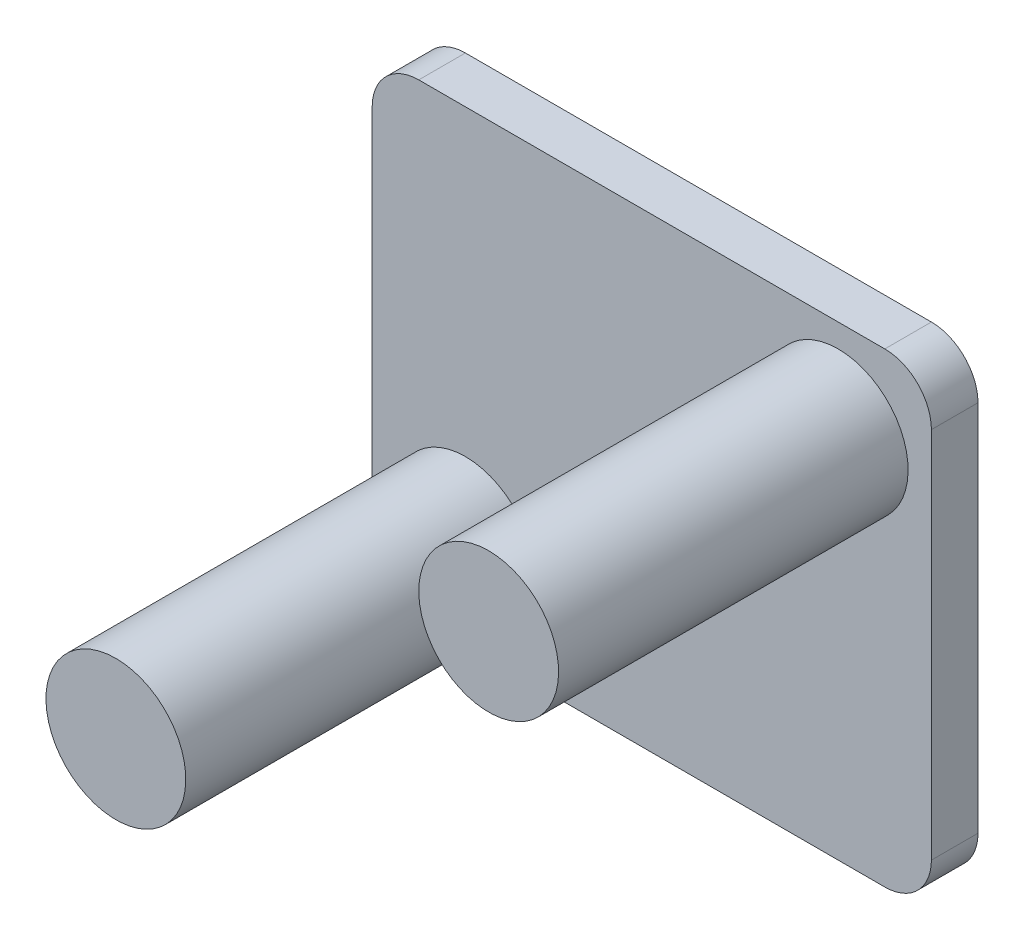
ISO-10303-21;
HEADER;
FILE_DESCRIPTION(('STEP AP214'),'2;1');
FILE_NAME('part.step','',(''),(''),'','','');
FILE_SCHEMA(('AUTOMOTIVE_DESIGN { 1 0 10303 214 1 1 1 1 }'));
ENDSEC;
DATA;
#1=APPLICATION_CONTEXT('core data for automotive mechanical design processes');
#2=APPLICATION_PROTOCOL_DEFINITION('international standard','automotive_design',2000,#1);
#3=PRODUCT_CONTEXT('',#1,'mechanical');
#4=PRODUCT('Part','Part','',(#3));
#5=PRODUCT_RELATED_PRODUCT_CATEGORY('part','',(#4));
#6=PRODUCT_DEFINITION_FORMATION('','',#4);
#7=PRODUCT_DEFINITION_CONTEXT('part definition',#1,'design');
#8=PRODUCT_DEFINITION('design','',#6,#7);
#9=PRODUCT_DEFINITION_SHAPE('','',#8);
#10=(LENGTH_UNIT() NAMED_UNIT(*) SI_UNIT(.MILLI.,.METRE.));
#11=(NAMED_UNIT(*) PLANE_ANGLE_UNIT() SI_UNIT($,.RADIAN.));
#12=(NAMED_UNIT(*) SI_UNIT($,.STERADIAN.) SOLID_ANGLE_UNIT());
#13=UNCERTAINTY_MEASURE_WITH_UNIT(LENGTH_MEASURE(1.E-05),#10,'distance_accuracy_value','');
#14=(GEOMETRIC_REPRESENTATION_CONTEXT(3) GLOBAL_UNCERTAINTY_ASSIGNED_CONTEXT((#13)) GLOBAL_UNIT_ASSIGNED_CONTEXT((#10,
#11,#12)) REPRESENTATION_CONTEXT('',''));
#15=CARTESIAN_POINT('',(0.,0.,0.));
#16=DIRECTION('',(0.,0.,1.));
#17=DIRECTION('',(1.,0.,0.));
#18=AXIS2_PLACEMENT_3D('',#15,#16,#17);
#19=CARTESIAN_POINT('',(5.5,3.,8.5));
#20=DIRECTION('',(0.,0.,-1.));
#21=DIRECTION('',(0.,1.,0.));
#22=AXIS2_PLACEMENT_3D('',#19,#20,#21);
#23=PLANE('',#22);
#24=CARTESIAN_POINT('',(4.,3.,8.5));
#25=DIRECTION('',(0.,0.,-1.));
#26=DIRECTION('',(0.,1.,0.));
#27=AXIS2_PLACEMENT_3D('',#24,#25,#26);
#28=CIRCLE('',#27,1.5);
#29=CARTESIAN_POINT('',(4.,4.5,8.5));
#30=VERTEX_POINT('',#29);
#31=EDGE_CURVE('E20',#30,#30,#28,.T.);
#32=ORIENTED_EDGE('',*,*,#31,.F.);
#33=EDGE_LOOP('',(#32));
#34=FACE_BOUND('',#33,.T.);
#35=ADVANCED_FACE('F17',(#34),#23,.F.);
#36=CARTESIAN_POINT('',(-2.5,-3.,8.5));
#37=DIRECTION('',(0.,0.,-1.));
#38=DIRECTION('',(0.,1.,0.));
#39=AXIS2_PLACEMENT_3D('',#36,#37,#38);
#40=PLANE('',#39);
#41=CARTESIAN_POINT('',(-4.,-3.,8.5));
#42=DIRECTION('',(0.,0.,-1.));
#43=DIRECTION('',(0.,1.,0.));
#44=AXIS2_PLACEMENT_3D('',#41,#42,#43);
#45=CIRCLE('',#44,1.5);
#46=CARTESIAN_POINT('',(-4.,-1.5,8.5));
#47=VERTEX_POINT('',#46);
#48=EDGE_CURVE('E140',#47,#47,#45,.T.);
#49=ORIENTED_EDGE('',*,*,#48,.F.);
#50=EDGE_LOOP('',(#49));
#51=FACE_BOUND('',#50,.T.);
#52=ADVANCED_FACE('F151',(#51),#40,.F.);
#53=CARTESIAN_POINT('',(4.,3.,1.));
#54=DIRECTION('',(0.,0.,-1.));
#55=DIRECTION('',(0.,1.,0.));
#56=AXIS2_PLACEMENT_3D('',#53,#54,#55);
#57=CYLINDRICAL_SURFACE('',#56,1.5);
#58=ORIENTED_EDGE('',*,*,#31,.T.);
#59=EDGE_LOOP('',(#58));
#60=FACE_BOUND('',#59,.T.);
#61=CARTESIAN_POINT('',(4.,3.,1.));
#62=DIRECTION('',(0.,0.,-1.));
#63=DIRECTION('',(0.,1.,0.));
#64=AXIS2_PLACEMENT_3D('',#61,#62,#63);
#65=CIRCLE('',#64,1.5);
#66=CARTESIAN_POINT('',(4.,4.5,0.999999999999999));
#67=VERTEX_POINT('',#66);
#68=EDGE_CURVE('E138',#67,#67,#65,.F.);
#69=ORIENTED_EDGE('',*,*,#68,.T.);
#70=EDGE_LOOP('',(#69));
#71=FACE_BOUND('',#70,.T.);
#72=ADVANCED_FACE('F147',(#60,#71),#57,.T.);
#73=CARTESIAN_POINT('',(-4.,-3.,1.));
#74=DIRECTION('',(0.,0.,-1.));
#75=DIRECTION('',(0.,1.,0.));
#76=AXIS2_PLACEMENT_3D('',#73,#74,#75);
#77=CYLINDRICAL_SURFACE('',#76,1.5);
#78=ORIENTED_EDGE('',*,*,#48,.T.);
#79=EDGE_LOOP('',(#78));
#80=FACE_BOUND('',#79,.T.);
#81=CARTESIAN_POINT('',(-4.,-3.,1.));
#82=DIRECTION('',(0.,0.,-1.));
#83=DIRECTION('',(0.,1.,0.));
#84=AXIS2_PLACEMENT_3D('',#81,#82,#83);
#85=CIRCLE('',#84,1.5);
#86=CARTESIAN_POINT('',(-4.,-1.5,0.999999999999999));
#87=VERTEX_POINT('',#86);
#88=EDGE_CURVE('E90',#87,#87,#85,.F.);
#89=ORIENTED_EDGE('',*,*,#88,.T.);
#90=EDGE_LOOP('',(#89));
#91=FACE_BOUND('',#90,.T.);
#92=ADVANCED_FACE('F193',(#80,#91),#77,.T.);
#93=CARTESIAN_POINT('',(-4.99999999994,-4.999999999969,1.));
#94=DIRECTION('',(0.,0.,-1.));
#95=DIRECTION('',(0.,1.,0.));
#96=AXIS2_PLACEMENT_3D('',#93,#94,#95);
#97=PLANE('',#96);
#98=ORIENTED_EDGE('',*,*,#88,.F.);
#99=EDGE_LOOP('',(#98));
#100=FACE_BOUND('',#99,.T.);
#101=ORIENTED_EDGE('',*,*,#68,.F.);
#102=EDGE_LOOP('',(#101));
#103=FACE_BOUND('',#102,.T.);
#104=DIRECTION('',(0.,1.,0.));
#105=VECTOR('',#104,1.);
#106=CARTESIAN_POINT('',(6.,-4.000000000026,1.));
#107=LINE('',#106,#105);
#108=CARTESIAN_POINT('',(6.,-4.000000000026,1.));
#109=VERTEX_POINT('',#108);
#110=CARTESIAN_POINT('',(6.,4.000000000018,1.));
#111=VERTEX_POINT('',#110);
#112=EDGE_CURVE('E107',#109,#111,#107,.T.);
#113=ORIENTED_EDGE('',*,*,#112,.T.);
#114=CARTESIAN_POINT('',(5.000000000026,4.000000000018,1.));
#115=DIRECTION('',(0.,0.,-1.));
#116=DIRECTION('',(-1.,0.,0.));
#117=AXIS2_PLACEMENT_3D('',#114,#115,#116);
#118=CIRCLE('',#117,0.999999999974);
#119=CARTESIAN_POINT('',(5.000000000026,4.999999999992,1.));
#120=VERTEX_POINT('',#119);
#121=EDGE_CURVE('E110',#120,#111,#118,.T.);
#122=ORIENTED_EDGE('',*,*,#121,.F.);
#123=DIRECTION('',(1.,0.,0.));
#124=VECTOR('',#123,1.);
#125=CARTESIAN_POINT('',(5.000000000026,4.999999999992,1.));
#126=LINE('',#125,#124);
#127=CARTESIAN_POINT('',(-4.999999999989,4.999999999992,1.));
#128=VERTEX_POINT('',#127);
#129=EDGE_CURVE('E111',#120,#128,#126,.F.);
#130=ORIENTED_EDGE('',*,*,#129,.T.);
#131=CARTESIAN_POINT('',(-4.999999999989,4.000000000018,1.));
#132=DIRECTION('',(0.,0.,-1.));
#133=DIRECTION('',(-1.,0.,0.));
#134=AXIS2_PLACEMENT_3D('',#131,#132,#133);
#135=CIRCLE('',#134,0.999999999974);
#136=CARTESIAN_POINT('',(-5.9999999999815,4.000000000018,1.));
#137=VERTEX_POINT('',#136);
#138=EDGE_CURVE('E114',#137,#128,#135,.T.);
#139=ORIENTED_EDGE('',*,*,#138,.F.);
#140=DIRECTION('',(0.,1.,0.));
#141=VECTOR('',#140,1.);
#142=CARTESIAN_POINT('',(-6.,4.00000000005,1.));
#143=LINE('',#142,#141);
#144=CARTESIAN_POINT('',(-6.,-3.999999999995,1.));
#145=VERTEX_POINT('',#144);
#146=EDGE_CURVE('E87',#137,#145,#143,.F.);
#147=ORIENTED_EDGE('',*,*,#146,.T.);
#148=CARTESIAN_POINT('',(-5.000000000026,-3.999999999995,1.));
#149=DIRECTION('',(0.,0.,-1.));
#150=DIRECTION('',(-1.,0.,0.));
#151=AXIS2_PLACEMENT_3D('',#148,#149,#150);
#152=CIRCLE('',#151,0.999999999974);
#153=CARTESIAN_POINT('',(-4.999999999983,-4.999999999969,1.));
#154=VERTEX_POINT('',#153);
#155=EDGE_CURVE('E80',#154,#145,#152,.T.);
#156=ORIENTED_EDGE('',*,*,#155,.F.);
#157=DIRECTION('',(1.,0.,0.));
#158=VECTOR('',#157,1.);
#159=CARTESIAN_POINT('',(-4.99999999994,-4.999999999969,1.));
#160=LINE('',#159,#158);
#161=CARTESIAN_POINT('',(5.000000000026,-4.999999999969,1.));
#162=VERTEX_POINT('',#161);
#163=EDGE_CURVE('E85',#154,#162,#160,.T.);
#164=ORIENTED_EDGE('',*,*,#163,.T.);
#165=CARTESIAN_POINT('',(5.000000000026,-4.000000000026,1.));
#166=DIRECTION('',(0.,0.,-1.));
#167=DIRECTION('',(-1.,0.,0.));
#168=AXIS2_PLACEMENT_3D('',#165,#166,#167);
#169=CIRCLE('',#168,0.999999999974);
#170=EDGE_CURVE('E98',#109,#162,#169,.T.);
#171=ORIENTED_EDGE('',*,*,#170,.F.);
#172=EDGE_LOOP('',(#113,#122,#130,#139,#147,#156,#164,#171));
#173=FACE_BOUND('',#172,.T.);
#174=ADVANCED_FACE('F82',(#100,#103,#173),#97,.F.);
#175=CARTESIAN_POINT('',(-5.000000000026,-3.999999999995,0.));
#176=DIRECTION('',(0.,0.,-1.));
#177=DIRECTION('',(-1.,0.,0.));
#178=AXIS2_PLACEMENT_3D('',#175,#176,#177);
#179=CYLINDRICAL_SURFACE('',#178,0.999999999974);
#180=ORIENTED_EDGE('',*,*,#155,.T.);
#181=DIRECTION('',(0.,0.,-1.));
#182=VECTOR('',#181,1.);
#183=CARTESIAN_POINT('',(-6.,-3.999999999995,0.));
#184=LINE('',#183,#182);
#185=CARTESIAN_POINT('',(-6.,-3.999999999995,0.));
#186=VERTEX_POINT('',#185);
#187=EDGE_CURVE('E105',#145,#186,#184,.T.);
#188=ORIENTED_EDGE('',*,*,#187,.T.);
#189=CARTESIAN_POINT('',(-5.000000000026,-3.999999999995,0.));
#190=DIRECTION('',(0.,0.,-1.));
#191=DIRECTION('',(-1.,0.,0.));
#192=AXIS2_PLACEMENT_3D('',#189,#190,#191);
#193=CIRCLE('',#192,0.999999999974);
#194=CARTESIAN_POINT('',(-4.999999999983,-4.9999999999765,0.));
#195=VERTEX_POINT('',#194);
#196=EDGE_CURVE('E96',#195,#186,#193,.T.);
#197=ORIENTED_EDGE('',*,*,#196,.F.);
#198=DIRECTION('',(0.,0.,1.));
#199=VECTOR('',#198,1.);
#200=CARTESIAN_POINT('',(-4.99999999994,-4.999999999969,0.));
#201=LINE('',#200,#199);
#202=EDGE_CURVE('E93',#195,#154,#201,.T.);
#203=ORIENTED_EDGE('',*,*,#202,.T.);
#204=EDGE_LOOP('',(#180,#188,#197,#203));
#205=FACE_BOUND('',#204,.T.);
#206=ADVANCED_FACE('F94',(#205),#179,.T.);
#207=CARTESIAN_POINT('',(-6.,4.00000000005,0.));
#208=DIRECTION('',(1.,0.,0.));
#209=DIRECTION('',(0.,0.,-1.));
#210=AXIS2_PLACEMENT_3D('',#207,#208,#209);
#211=PLANE('',#210);
#212=ORIENTED_EDGE('',*,*,#187,.F.);
#213=ORIENTED_EDGE('',*,*,#146,.F.);
#214=DIRECTION('',(0.,0.,-1.));
#215=VECTOR('',#214,1.);
#216=CARTESIAN_POINT('',(-5.999999999963,4.000000000018,0.));
#217=LINE('',#216,#215);
#218=CARTESIAN_POINT('',(-5.9999999999815,4.000000000018,0.));
#219=VERTEX_POINT('',#218);
#220=EDGE_CURVE('E134',#219,#137,#217,.F.);
#221=ORIENTED_EDGE('',*,*,#220,.F.);
#222=DIRECTION('',(0.,1.,0.));
#223=VECTOR('',#222,1.);
#224=CARTESIAN_POINT('',(-6.,-4.999999999969,0.));
#225=LINE('',#224,#223);
#226=EDGE_CURVE('E126',#186,#219,#225,.T.);
#227=ORIENTED_EDGE('',*,*,#226,.F.);
#228=EDGE_LOOP('',(#212,#213,#221,#227));
#229=FACE_BOUND('',#228,.T.);
#230=ADVANCED_FACE('F184',(#229),#211,.F.);
#231=CARTESIAN_POINT('',(-4.999999999989,4.000000000018,0.));
#232=DIRECTION('',(0.,0.,-1.));
#233=DIRECTION('',(-1.,0.,0.));
#234=AXIS2_PLACEMENT_3D('',#231,#232,#233);
#235=CYLINDRICAL_SURFACE('',#234,0.999999999974);
#236=ORIENTED_EDGE('',*,*,#138,.T.);
#237=DIRECTION('',(0.,0.,-1.));
#238=VECTOR('',#237,1.);
#239=CARTESIAN_POINT('',(-4.999999999989,4.999999999992,0.));
#240=LINE('',#239,#238);
#241=CARTESIAN_POINT('',(-4.999999999989,4.999999999992,0.));
#242=VERTEX_POINT('',#241);
#243=EDGE_CURVE('E113',#128,#242,#240,.T.);
#244=ORIENTED_EDGE('',*,*,#243,.T.);
#245=CARTESIAN_POINT('',(-4.999999999989,4.000000000018,0.));
#246=DIRECTION('',(0.,0.,-1.));
#247=DIRECTION('',(-1.,0.,0.));
#248=AXIS2_PLACEMENT_3D('',#245,#246,#247);
#249=CIRCLE('',#248,0.999999999974);
#250=EDGE_CURVE('E123',#219,#242,#249,.T.);
#251=ORIENTED_EDGE('',*,*,#250,.F.);
#252=ORIENTED_EDGE('',*,*,#220,.T.);
#253=EDGE_LOOP('',(#236,#244,#251,#252));
#254=FACE_BOUND('',#253,.T.);
#255=ADVANCED_FACE('F180',(#254),#235,.T.);
#256=CARTESIAN_POINT('',(5.000000000026,4.999999999992,0.));
#257=DIRECTION('',(0.,-1.,0.));
#258=DIRECTION('',(0.,0.,-1.));
#259=AXIS2_PLACEMENT_3D('',#256,#257,#258);
#260=PLANE('',#259);
#261=ORIENTED_EDGE('',*,*,#243,.F.);
#262=ORIENTED_EDGE('',*,*,#129,.F.);
#263=DIRECTION('',(0.,0.,-1.));
#264=VECTOR('',#263,1.);
#265=CARTESIAN_POINT('',(5.000000000026,4.999999999992,0.));
#266=LINE('',#265,#264);
#267=CARTESIAN_POINT('',(5.000000000026,4.999999999992,0.));
#268=VERTEX_POINT('',#267);
#269=EDGE_CURVE('E132',#268,#120,#266,.F.);
#270=ORIENTED_EDGE('',*,*,#269,.F.);
#271=DIRECTION('',(1.,0.,0.));
#272=VECTOR('',#271,1.);
#273=CARTESIAN_POINT('',(-4.99999999994,4.999999999992,0.));
#274=LINE('',#273,#272);
#275=EDGE_CURVE('E122',#242,#268,#274,.T.);
#276=ORIENTED_EDGE('',*,*,#275,.F.);
#277=EDGE_LOOP('',(#261,#262,#270,#276));
#278=FACE_BOUND('',#277,.T.);
#279=ADVANCED_FACE('F176',(#278),#260,.F.);
#280=CARTESIAN_POINT('',(5.000000000026,4.000000000018,0.));
#281=DIRECTION('',(0.,0.,-1.));
#282=DIRECTION('',(-1.,0.,0.));
#283=AXIS2_PLACEMENT_3D('',#280,#281,#282);
#284=CYLINDRICAL_SURFACE('',#283,0.999999999974);
#285=ORIENTED_EDGE('',*,*,#121,.T.);
#286=DIRECTION('',(0.,0.,1.));
#287=VECTOR('',#286,1.);
#288=CARTESIAN_POINT('',(6.,4.000000000018,0.));
#289=LINE('',#288,#287);
#290=CARTESIAN_POINT('',(6.,4.000000000018,0.));
#291=VERTEX_POINT('',#290);
#292=EDGE_CURVE('E109',#111,#291,#289,.F.);
#293=ORIENTED_EDGE('',*,*,#292,.T.);
#294=CARTESIAN_POINT('',(5.000000000026,4.000000000018,0.));
#295=DIRECTION('',(0.,0.,-1.));
#296=DIRECTION('',(-1.,0.,0.));
#297=AXIS2_PLACEMENT_3D('',#294,#295,#296);
#298=CIRCLE('',#297,0.999999999974);
#299=EDGE_CURVE('E119',#268,#291,#298,.T.);
#300=ORIENTED_EDGE('',*,*,#299,.F.);
#301=ORIENTED_EDGE('',*,*,#269,.T.);
#302=EDGE_LOOP('',(#285,#293,#300,#301));
#303=FACE_BOUND('',#302,.T.);
#304=ADVANCED_FACE('F172',(#303),#284,.T.);
#305=CARTESIAN_POINT('',(6.,-4.000000000026,0.));
#306=DIRECTION('',(-1.,0.,0.));
#307=DIRECTION('',(0.,0.,1.));
#308=AXIS2_PLACEMENT_3D('',#305,#306,#307);
#309=PLANE('',#308);
#310=ORIENTED_EDGE('',*,*,#292,.F.);
#311=ORIENTED_EDGE('',*,*,#112,.F.);
#312=DIRECTION('',(0.,0.,-1.));
#313=VECTOR('',#312,1.);
#314=CARTESIAN_POINT('',(6.,-4.000000000026,0.));
#315=LINE('',#314,#313);
#316=CARTESIAN_POINT('',(6.,-4.000000000026,0.));
#317=VERTEX_POINT('',#316);
#318=EDGE_CURVE('E129',#317,#109,#315,.F.);
#319=ORIENTED_EDGE('',*,*,#318,.F.);
#320=DIRECTION('',(0.,1.,0.));
#321=VECTOR('',#320,1.);
#322=CARTESIAN_POINT('',(6.,-4.999999999969,0.));
#323=LINE('',#322,#321);
#324=EDGE_CURVE('E118',#291,#317,#323,.F.);
#325=ORIENTED_EDGE('',*,*,#324,.F.);
#326=EDGE_LOOP('',(#310,#311,#319,#325));
#327=FACE_BOUND('',#326,.T.);
#328=ADVANCED_FACE('F169',(#327),#309,.F.);
#329=CARTESIAN_POINT('',(5.000000000026,-4.000000000026,0.));
#330=DIRECTION('',(0.,0.,-1.));
#331=DIRECTION('',(-1.,0.,0.));
#332=AXIS2_PLACEMENT_3D('',#329,#330,#331);
#333=CYLINDRICAL_SURFACE('',#332,0.999999999974);
#334=ORIENTED_EDGE('',*,*,#170,.T.);
#335=DIRECTION('',(0.,0.,1.));
#336=VECTOR('',#335,1.);
#337=CARTESIAN_POINT('',(5.000000000026,-4.999999999969,0.));
#338=LINE('',#337,#336);
#339=CARTESIAN_POINT('',(5.000000000026,-4.9999999999765,0.));
#340=VERTEX_POINT('',#339);
#341=EDGE_CURVE('E35',#162,#340,#338,.F.);
#342=ORIENTED_EDGE('',*,*,#341,.T.);
#343=CARTESIAN_POINT('',(5.000000000026,-4.000000000026,0.));
#344=DIRECTION('',(0.,0.,-1.));
#345=DIRECTION('',(-1.,0.,0.));
#346=AXIS2_PLACEMENT_3D('',#343,#344,#345);
#347=CIRCLE('',#346,0.999999999974);
#348=EDGE_CURVE('E26',#317,#340,#347,.T.);
#349=ORIENTED_EDGE('',*,*,#348,.F.);
#350=ORIENTED_EDGE('',*,*,#318,.T.);
#351=EDGE_LOOP('',(#334,#342,#349,#350));
#352=FACE_BOUND('',#351,.T.);
#353=ADVANCED_FACE('F164',(#352),#333,.T.);
#354=CARTESIAN_POINT('',(-4.99999999994,-4.999999999969,0.));
#355=DIRECTION('',(0.,1.,0.));
#356=DIRECTION('',(0.,0.,1.));
#357=AXIS2_PLACEMENT_3D('',#354,#355,#356);
#358=PLANE('',#357);
#359=ORIENTED_EDGE('',*,*,#341,.F.);
#360=ORIENTED_EDGE('',*,*,#163,.F.);
#361=ORIENTED_EDGE('',*,*,#202,.F.);
#362=DIRECTION('',(1.,0.,0.));
#363=VECTOR('',#362,1.);
#364=CARTESIAN_POINT('',(-4.99999999994,-4.999999999984,0.));
#365=LINE('',#364,#363);
#366=EDGE_CURVE('E11',#340,#195,#365,.F.);
#367=ORIENTED_EDGE('',*,*,#366,.F.);
#368=EDGE_LOOP('',(#359,#360,#361,#367));
#369=FACE_BOUND('',#368,.T.);
#370=ADVANCED_FACE('F100',(#369),#358,.F.);
#371=CARTESIAN_POINT('',(-4.99999999994,-4.999999999969,0.));
#372=DIRECTION('',(0.,0.,-1.));
#373=DIRECTION('',(0.,1.,0.));
#374=AXIS2_PLACEMENT_3D('',#371,#372,#373);
#375=PLANE('',#374);
#376=ORIENTED_EDGE('',*,*,#348,.T.);
#377=ORIENTED_EDGE('',*,*,#366,.T.);
#378=ORIENTED_EDGE('',*,*,#196,.T.);
#379=ORIENTED_EDGE('',*,*,#226,.T.);
#380=ORIENTED_EDGE('',*,*,#250,.T.);
#381=ORIENTED_EDGE('',*,*,#275,.T.);
#382=ORIENTED_EDGE('',*,*,#299,.T.);
#383=ORIENTED_EDGE('',*,*,#324,.T.);
#384=EDGE_LOOP('',(#376,#377,#378,#379,#380,#381,#382,#383));
#385=FACE_BOUND('',#384,.T.);
#386=ADVANCED_FACE('F157',(#385),#375,.T.);
#387=CLOSED_SHELL('',(#35,#52,#72,#92,#174,#206,#230,#255,#279,#304,#328,#353,#370,#386));
#388=MANIFOLD_SOLID_BREP('B1',#387);
#389=ADVANCED_BREP_SHAPE_REPRESENTATION('',(#18,#388),#14);
#390=SHAPE_DEFINITION_REPRESENTATION(#9,#389);
ENDSEC;
END-ISO-10303-21;
